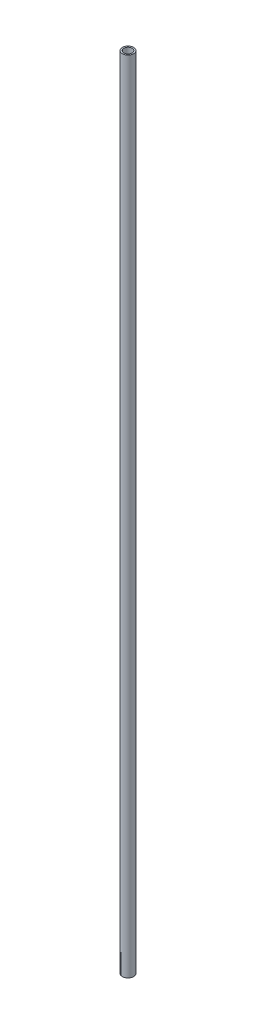
ISO-10303-21;
HEADER;
FILE_DESCRIPTION(('STEP AP214'),'2;1');
FILE_NAME('part.step','',(''),(''),'','','');
FILE_SCHEMA(('AUTOMOTIVE_DESIGN { 1 0 10303 214 1 1 1 1 }'));
ENDSEC;
DATA;
#1=APPLICATION_CONTEXT('core data for automotive mechanical design processes');
#2=APPLICATION_PROTOCOL_DEFINITION('international standard','automotive_design',2000,#1);
#3=PRODUCT_CONTEXT('',#1,'mechanical');
#4=PRODUCT('Part','Part','',(#3));
#5=PRODUCT_RELATED_PRODUCT_CATEGORY('part','',(#4));
#6=PRODUCT_DEFINITION_FORMATION('','',#4);
#7=PRODUCT_DEFINITION_CONTEXT('part definition',#1,'design');
#8=PRODUCT_DEFINITION('design','',#6,#7);
#9=PRODUCT_DEFINITION_SHAPE('','',#8);
#10=(LENGTH_UNIT() NAMED_UNIT(*) SI_UNIT(.MILLI.,.METRE.));
#11=(NAMED_UNIT(*) PLANE_ANGLE_UNIT() SI_UNIT($,.RADIAN.));
#12=(NAMED_UNIT(*) SI_UNIT($,.STERADIAN.) SOLID_ANGLE_UNIT());
#13=UNCERTAINTY_MEASURE_WITH_UNIT(LENGTH_MEASURE(1.E-05),#10,'distance_accuracy_value','');
#14=(GEOMETRIC_REPRESENTATION_CONTEXT(3) GLOBAL_UNCERTAINTY_ASSIGNED_CONTEXT((#13)) GLOBAL_UNIT_ASSIGNED_CONTEXT((#10,
#11,#12)) REPRESENTATION_CONTEXT('',''));
#15=CARTESIAN_POINT('',(0.,0.,0.));
#16=DIRECTION('',(0.,0.,1.));
#17=DIRECTION('',(1.,0.,0.));
#18=AXIS2_PLACEMENT_3D('',#15,#16,#17);
#19=CARTESIAN_POINT('',(0.,1524.,0.));
#20=DIRECTION('',(0.,1.,0.));
#21=DIRECTION('',(0.,0.,1.));
#22=AXIS2_PLACEMENT_3D('',#19,#20,#21);
#23=PLANE('',#22);
#24=CARTESIAN_POINT('',(0.,1524.,0.));
#25=DIRECTION('',(0.,1.,0.));
#26=DIRECTION('',(0.,0.,1.));
#27=AXIS2_PLACEMENT_3D('',#24,#25,#26);
#28=CIRCLE('',#27,10.668);
#29=CARTESIAN_POINT('',(0.,1524.,10.668));
#30=VERTEX_POINT('',#29);
#31=EDGE_CURVE('E10',#30,#30,#28,.T.);
#32=ORIENTED_EDGE('',*,*,#31,.T.);
#33=EDGE_LOOP('',(#32));
#34=FACE_BOUND('',#33,.T.);
#35=CARTESIAN_POINT('',(0.,1524.,0.));
#36=DIRECTION('',(0.,1.,0.));
#37=DIRECTION('',(0.,0.,1.));
#38=AXIS2_PLACEMENT_3D('',#35,#36,#37);
#39=CIRCLE('',#38,7.8994);
#40=CARTESIAN_POINT('',(0.,1524.,7.8994));
#41=VERTEX_POINT('',#40);
#42=EDGE_CURVE('E44',#41,#41,#39,.T.);
#43=ORIENTED_EDGE('',*,*,#42,.F.);
#44=EDGE_LOOP('',(#43));
#45=FACE_BOUND('',#44,.T.);
#46=ADVANCED_FACE('F33',(#34,#45),#23,.T.);
#47=CARTESIAN_POINT('',(0.,0.,0.));
#48=DIRECTION('',(0.,1.,0.));
#49=DIRECTION('',(0.,0.,1.));
#50=AXIS2_PLACEMENT_3D('',#47,#48,#49);
#51=PLANE('',#50);
#52=CARTESIAN_POINT('',(0.,0.,0.));
#53=DIRECTION('',(0.,1.,0.));
#54=DIRECTION('',(0.,0.,1.));
#55=AXIS2_PLACEMENT_3D('',#52,#53,#54);
#56=CIRCLE('',#55,10.668);
#57=CARTESIAN_POINT('',(0.,0.,10.668));
#58=VERTEX_POINT('',#57);
#59=EDGE_CURVE('E37',#58,#58,#56,.T.);
#60=ORIENTED_EDGE('',*,*,#59,.F.);
#61=EDGE_LOOP('',(#60));
#62=FACE_BOUND('',#61,.T.);
#63=CARTESIAN_POINT('',(0.,0.,0.));
#64=DIRECTION('',(0.,1.,0.));
#65=DIRECTION('',(0.,0.,1.));
#66=AXIS2_PLACEMENT_3D('',#63,#64,#65);
#67=CIRCLE('',#66,7.8994);
#68=CARTESIAN_POINT('',(0.,0.,7.8994));
#69=VERTEX_POINT('',#68);
#70=EDGE_CURVE('E46',#69,#69,#67,.T.);
#71=ORIENTED_EDGE('',*,*,#70,.T.);
#72=EDGE_LOOP('',(#71));
#73=FACE_BOUND('',#72,.T.);
#74=ADVANCED_FACE('F56',(#62,#73),#51,.F.);
#75=CARTESIAN_POINT('',(0.,1524.,0.));
#76=DIRECTION('',(0.,-1.,0.));
#77=DIRECTION('',(0.,0.,-1.));
#78=AXIS2_PLACEMENT_3D('',#75,#76,#77);
#79=CYLINDRICAL_SURFACE('',#78,10.668);
#80=ORIENTED_EDGE('',*,*,#31,.F.);
#81=EDGE_LOOP('',(#80));
#82=FACE_BOUND('',#81,.T.);
#83=ORIENTED_EDGE('',*,*,#59,.T.);
#84=EDGE_LOOP('',(#83));
#85=FACE_BOUND('',#84,.T.);
#86=ADVANCED_FACE('F35',(#82,#85),#79,.T.);
#87=CARTESIAN_POINT('',(0.,1524.,0.));
#88=DIRECTION('',(0.,-1.,0.));
#89=DIRECTION('',(0.,0.,-1.));
#90=AXIS2_PLACEMENT_3D('',#87,#88,#89);
#91=CYLINDRICAL_SURFACE('',#90,7.8994);
#92=ORIENTED_EDGE('',*,*,#42,.T.);
#93=EDGE_LOOP('',(#92));
#94=FACE_BOUND('',#93,.T.);
#95=ORIENTED_EDGE('',*,*,#70,.F.);
#96=EDGE_LOOP('',(#95));
#97=FACE_BOUND('',#96,.T.);
#98=ADVANCED_FACE('F52',(#94,#97),#91,.F.);
#99=CLOSED_SHELL('',(#46,#74,#86,#98));
#100=MANIFOLD_SOLID_BREP('B2',#99);
#101=ADVANCED_BREP_SHAPE_REPRESENTATION('',(#18,#100),#14);
#102=SHAPE_DEFINITION_REPRESENTATION(#9,#101);
ENDSEC;
END-ISO-10303-21;
